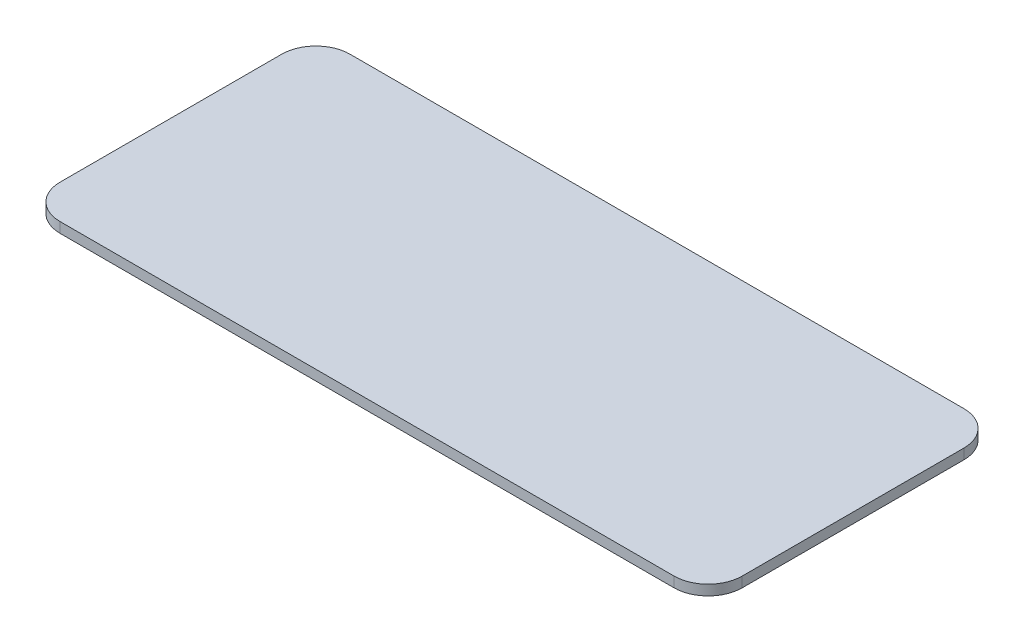
ISO-10303-21;
HEADER;
FILE_DESCRIPTION(('STEP AP214'),'2;1');
FILE_NAME('part.step','',(''),(''),'','','');
FILE_SCHEMA(('AUTOMOTIVE_DESIGN { 1 0 10303 214 1 1 1 1 }'));
ENDSEC;
DATA;
#1=APPLICATION_CONTEXT('core data for automotive mechanical design processes');
#2=APPLICATION_PROTOCOL_DEFINITION('international standard','automotive_design',2000,#1);
#3=PRODUCT_CONTEXT('',#1,'mechanical');
#4=PRODUCT('Part','Part','',(#3));
#5=PRODUCT_RELATED_PRODUCT_CATEGORY('part','',(#4));
#6=PRODUCT_DEFINITION_FORMATION('','',#4);
#7=PRODUCT_DEFINITION_CONTEXT('part definition',#1,'design');
#8=PRODUCT_DEFINITION('design','',#6,#7);
#9=PRODUCT_DEFINITION_SHAPE('','',#8);
#10=(LENGTH_UNIT() NAMED_UNIT(*) SI_UNIT(.MILLI.,.METRE.));
#11=(NAMED_UNIT(*) PLANE_ANGLE_UNIT() SI_UNIT($,.RADIAN.));
#12=(NAMED_UNIT(*) SI_UNIT($,.STERADIAN.) SOLID_ANGLE_UNIT());
#13=UNCERTAINTY_MEASURE_WITH_UNIT(LENGTH_MEASURE(1.E-05),#10,'distance_accuracy_value','');
#14=(GEOMETRIC_REPRESENTATION_CONTEXT(3) GLOBAL_UNCERTAINTY_ASSIGNED_CONTEXT((#13)) GLOBAL_UNIT_ASSIGNED_CONTEXT((#10,
#11,#12)) REPRESENTATION_CONTEXT('',''));
#15=CARTESIAN_POINT('',(0.,0.,0.));
#16=DIRECTION('',(0.,0.,1.));
#17=DIRECTION('',(1.,0.,0.));
#18=AXIS2_PLACEMENT_3D('',#15,#16,#17);
#19=CARTESIAN_POINT('',(-90.,3.,32.5));
#20=DIRECTION('',(0.,-1.,0.));
#21=DIRECTION('',(0.,0.,-1.));
#22=AXIS2_PLACEMENT_3D('',#19,#20,#21);
#23=CYLINDRICAL_SURFACE('',#22,10.);
#24=CARTESIAN_POINT('',(-90.,0.,32.5));
#25=DIRECTION('',(0.,1.,0.));
#26=DIRECTION('',(0.,0.,1.));
#27=AXIS2_PLACEMENT_3D('',#24,#25,#26);
#28=CIRCLE('',#27,10.);
#29=CARTESIAN_POINT('',(-100.,0.,32.4999999999999));
#30=VERTEX_POINT('',#29);
#31=CARTESIAN_POINT('',(-89.9999999999999,0.,42.5));
#32=VERTEX_POINT('',#31);
#33=EDGE_CURVE('E140',#30,#32,#28,.T.);
#34=ORIENTED_EDGE('',*,*,#33,.T.);
#35=DIRECTION('',(0.,-1.,0.));
#36=VECTOR('',#35,1.);
#37=CARTESIAN_POINT('',(-89.9999999999999,3.,42.5));
#38=LINE('',#37,#36);
#39=CARTESIAN_POINT('',(-89.9999999999999,3.,42.5));
#40=VERTEX_POINT('',#39);
#41=EDGE_CURVE('E11',#40,#32,#38,.T.);
#42=ORIENTED_EDGE('',*,*,#41,.F.);
#43=CARTESIAN_POINT('',(-90.,3.,32.5));
#44=DIRECTION('',(0.,1.,0.));
#45=DIRECTION('',(0.,0.,1.));
#46=AXIS2_PLACEMENT_3D('',#43,#44,#45);
#47=CIRCLE('',#46,10.);
#48=CARTESIAN_POINT('',(-100.,3.,32.4999999999999));
#49=VERTEX_POINT('',#48);
#50=EDGE_CURVE('E162',#49,#40,#47,.T.);
#51=ORIENTED_EDGE('',*,*,#50,.F.);
#52=DIRECTION('',(0.,-1.,0.));
#53=VECTOR('',#52,1.);
#54=CARTESIAN_POINT('',(-100.,3.,32.4999999999999));
#55=LINE('',#54,#53);
#56=EDGE_CURVE('E136',#49,#30,#55,.T.);
#57=ORIENTED_EDGE('',*,*,#56,.T.);
#58=EDGE_LOOP('',(#34,#42,#51,#57));
#59=FACE_BOUND('',#58,.T.);
#60=ADVANCED_FACE('F39',(#59),#23,.T.);
#61=CARTESIAN_POINT('',(-89.9999999999999,3.,42.5));
#62=DIRECTION('',(0.,0.,-1.));
#63=DIRECTION('',(-1.,0.,0.));
#64=AXIS2_PLACEMENT_3D('',#61,#62,#63);
#65=PLANE('',#64);
#66=DIRECTION('',(1.,0.,0.));
#67=VECTOR('',#66,1.);
#68=CARTESIAN_POINT('',(-89.9999999999999,0.,42.5));
#69=LINE('',#68,#67);
#70=CARTESIAN_POINT('',(89.9999999999999,0.,42.5));
#71=VERTEX_POINT('',#70);
#72=EDGE_CURVE('E144',#32,#71,#69,.T.);
#73=ORIENTED_EDGE('',*,*,#72,.T.);
#74=DIRECTION('',(0.,-1.,0.));
#75=VECTOR('',#74,1.);
#76=CARTESIAN_POINT('',(89.9999999999999,3.,42.5));
#77=LINE('',#76,#75);
#78=CARTESIAN_POINT('',(89.9999999999999,3.,42.5));
#79=VERTEX_POINT('',#78);
#80=EDGE_CURVE('E48',#79,#71,#77,.T.);
#81=ORIENTED_EDGE('',*,*,#80,.F.);
#82=DIRECTION('',(1.,0.,0.));
#83=VECTOR('',#82,1.);
#84=CARTESIAN_POINT('',(-89.9999999999999,3.,42.5));
#85=LINE('',#84,#83);
#86=EDGE_CURVE('E99',#40,#79,#85,.T.);
#87=ORIENTED_EDGE('',*,*,#86,.F.);
#88=ORIENTED_EDGE('',*,*,#41,.T.);
#89=EDGE_LOOP('',(#73,#81,#87,#88));
#90=FACE_BOUND('',#89,.T.);
#91=ADVANCED_FACE('F208',(#90),#65,.F.);
#92=CARTESIAN_POINT('',(90.,3.,32.5));
#93=DIRECTION('',(0.,-1.,0.));
#94=DIRECTION('',(0.,0.,-1.));
#95=AXIS2_PLACEMENT_3D('',#92,#93,#94);
#96=CYLINDRICAL_SURFACE('',#95,10.);
#97=CARTESIAN_POINT('',(90.,0.,32.5));
#98=DIRECTION('',(0.,1.,0.));
#99=DIRECTION('',(0.,0.,1.));
#100=AXIS2_PLACEMENT_3D('',#97,#98,#99);
#101=CIRCLE('',#100,10.);
#102=CARTESIAN_POINT('',(100.,0.,32.4999999999999));
#103=VERTEX_POINT('',#102);
#104=EDGE_CURVE('E147',#71,#103,#101,.T.);
#105=ORIENTED_EDGE('',*,*,#104,.T.);
#106=DIRECTION('',(0.,-1.,0.));
#107=VECTOR('',#106,1.);
#108=CARTESIAN_POINT('',(100.,3.,32.4999999999999));
#109=LINE('',#108,#107);
#110=CARTESIAN_POINT('',(100.,3.,32.4999999999999));
#111=VERTEX_POINT('',#110);
#112=EDGE_CURVE('E173',#111,#103,#109,.T.);
#113=ORIENTED_EDGE('',*,*,#112,.F.);
#114=CARTESIAN_POINT('',(90.,3.,32.5));
#115=DIRECTION('',(0.,1.,0.));
#116=DIRECTION('',(0.,0.,1.));
#117=AXIS2_PLACEMENT_3D('',#114,#115,#116);
#118=CIRCLE('',#117,10.);
#119=EDGE_CURVE('E183',#79,#111,#118,.T.);
#120=ORIENTED_EDGE('',*,*,#119,.F.);
#121=ORIENTED_EDGE('',*,*,#80,.T.);
#122=EDGE_LOOP('',(#105,#113,#120,#121));
#123=FACE_BOUND('',#122,.T.);
#124=ADVANCED_FACE('F181',(#123),#96,.T.);
#125=CARTESIAN_POINT('',(100.,3.,-32.4999999999999));
#126=DIRECTION('',(-1.,0.,0.));
#127=DIRECTION('',(0.,0.,1.));
#128=AXIS2_PLACEMENT_3D('',#125,#126,#127);
#129=PLANE('',#128);
#130=DIRECTION('',(0.,0.,-1.));
#131=VECTOR('',#130,1.);
#132=CARTESIAN_POINT('',(100.,0.,-32.4999999999999));
#133=LINE('',#132,#131);
#134=CARTESIAN_POINT('',(100.,0.,-32.4999999999999));
#135=VERTEX_POINT('',#134);
#136=EDGE_CURVE('E150',#103,#135,#133,.T.);
#137=ORIENTED_EDGE('',*,*,#136,.T.);
#138=DIRECTION('',(0.,-1.,0.));
#139=VECTOR('',#138,1.);
#140=CARTESIAN_POINT('',(100.,3.,-32.4999999999999));
#141=LINE('',#140,#139);
#142=CARTESIAN_POINT('',(100.,3.,-32.4999999999999));
#143=VERTEX_POINT('',#142);
#144=EDGE_CURVE('E169',#143,#135,#141,.T.);
#145=ORIENTED_EDGE('',*,*,#144,.F.);
#146=DIRECTION('',(0.,0.,-1.));
#147=VECTOR('',#146,1.);
#148=CARTESIAN_POINT('',(100.,3.,-32.4999999999999));
#149=LINE('',#148,#147);
#150=EDGE_CURVE('E196',#111,#143,#149,.T.);
#151=ORIENTED_EDGE('',*,*,#150,.F.);
#152=ORIENTED_EDGE('',*,*,#112,.T.);
#153=EDGE_LOOP('',(#137,#145,#151,#152));
#154=FACE_BOUND('',#153,.T.);
#155=ADVANCED_FACE('F191',(#154),#129,.F.);
#156=CARTESIAN_POINT('',(90.,3.,-32.5));
#157=DIRECTION('',(0.,-1.,0.));
#158=DIRECTION('',(0.,0.,-1.));
#159=AXIS2_PLACEMENT_3D('',#156,#157,#158);
#160=CYLINDRICAL_SURFACE('',#159,10.);
#161=CARTESIAN_POINT('',(90.,0.,-32.5));
#162=DIRECTION('',(0.,1.,0.));
#163=DIRECTION('',(0.,0.,1.));
#164=AXIS2_PLACEMENT_3D('',#161,#162,#163);
#165=CIRCLE('',#164,10.);
#166=CARTESIAN_POINT('',(89.9999999999999,0.,-42.5));
#167=VERTEX_POINT('',#166);
#168=EDGE_CURVE('E153',#135,#167,#165,.T.);
#169=ORIENTED_EDGE('',*,*,#168,.T.);
#170=DIRECTION('',(0.,-1.,0.));
#171=VECTOR('',#170,1.);
#172=CARTESIAN_POINT('',(89.9999999999999,3.,-42.5));
#173=LINE('',#172,#171);
#174=CARTESIAN_POINT('',(89.9999999999999,3.,-42.5));
#175=VERTEX_POINT('',#174);
#176=EDGE_CURVE('E129',#175,#167,#173,.T.);
#177=ORIENTED_EDGE('',*,*,#176,.F.);
#178=CARTESIAN_POINT('',(90.,3.,-32.5));
#179=DIRECTION('',(0.,1.,0.));
#180=DIRECTION('',(0.,0.,1.));
#181=AXIS2_PLACEMENT_3D('',#178,#179,#180);
#182=CIRCLE('',#181,10.);
#183=EDGE_CURVE('E118',#143,#175,#182,.T.);
#184=ORIENTED_EDGE('',*,*,#183,.F.);
#185=ORIENTED_EDGE('',*,*,#144,.T.);
#186=EDGE_LOOP('',(#169,#177,#184,#185));
#187=FACE_BOUND('',#186,.T.);
#188=ADVANCED_FACE('F194',(#187),#160,.T.);
#189=CARTESIAN_POINT('',(-89.9999999999999,3.,-42.5));
#190=DIRECTION('',(0.,0.,1.));
#191=DIRECTION('',(1.,0.,0.));
#192=AXIS2_PLACEMENT_3D('',#189,#190,#191);
#193=PLANE('',#192);
#194=DIRECTION('',(-1.,0.,0.));
#195=VECTOR('',#194,1.);
#196=CARTESIAN_POINT('',(-89.9999999999999,0.,-42.5));
#197=LINE('',#196,#195);
#198=CARTESIAN_POINT('',(-89.9999999999999,0.,-42.5));
#199=VERTEX_POINT('',#198);
#200=EDGE_CURVE('E127',#167,#199,#197,.T.);
#201=ORIENTED_EDGE('',*,*,#200,.T.);
#202=DIRECTION('',(0.,-1.,0.));
#203=VECTOR('',#202,1.);
#204=CARTESIAN_POINT('',(-89.9999999999999,3.,-42.5));
#205=LINE('',#204,#203);
#206=CARTESIAN_POINT('',(-89.9999999999999,3.,-42.5));
#207=VERTEX_POINT('',#206);
#208=EDGE_CURVE('E124',#207,#199,#205,.T.);
#209=ORIENTED_EDGE('',*,*,#208,.F.);
#210=DIRECTION('',(-1.,0.,0.));
#211=VECTOR('',#210,1.);
#212=CARTESIAN_POINT('',(-89.9999999999999,3.,-42.5));
#213=LINE('',#212,#211);
#214=EDGE_CURVE('E112',#175,#207,#213,.T.);
#215=ORIENTED_EDGE('',*,*,#214,.F.);
#216=ORIENTED_EDGE('',*,*,#176,.T.);
#217=EDGE_LOOP('',(#201,#209,#215,#216));
#218=FACE_BOUND('',#217,.T.);
#219=ADVANCED_FACE('F125',(#218),#193,.F.);
#220=CARTESIAN_POINT('',(-90.,3.,-32.5));
#221=DIRECTION('',(0.,-1.,0.));
#222=DIRECTION('',(0.,0.,-1.));
#223=AXIS2_PLACEMENT_3D('',#220,#221,#222);
#224=CYLINDRICAL_SURFACE('',#223,10.);
#225=CARTESIAN_POINT('',(-90.,0.,-32.5));
#226=DIRECTION('',(0.,1.,0.));
#227=DIRECTION('',(0.,0.,1.));
#228=AXIS2_PLACEMENT_3D('',#225,#226,#227);
#229=CIRCLE('',#228,10.);
#230=CARTESIAN_POINT('',(-100.,0.,-32.4999999999999));
#231=VERTEX_POINT('',#230);
#232=EDGE_CURVE('E85',#199,#231,#229,.T.);
#233=ORIENTED_EDGE('',*,*,#232,.T.);
#234=DIRECTION('',(0.,-1.,0.));
#235=VECTOR('',#234,1.);
#236=CARTESIAN_POINT('',(-100.,3.,-32.4999999999999));
#237=LINE('',#236,#235);
#238=CARTESIAN_POINT('',(-100.,3.,-32.4999999999999));
#239=VERTEX_POINT('',#238);
#240=EDGE_CURVE('E130',#239,#231,#237,.T.);
#241=ORIENTED_EDGE('',*,*,#240,.F.);
#242=CARTESIAN_POINT('',(-90.,3.,-32.5));
#243=DIRECTION('',(0.,1.,0.));
#244=DIRECTION('',(0.,0.,1.));
#245=AXIS2_PLACEMENT_3D('',#242,#243,#244);
#246=CIRCLE('',#245,10.);
#247=EDGE_CURVE('E116',#207,#239,#246,.T.);
#248=ORIENTED_EDGE('',*,*,#247,.F.);
#249=ORIENTED_EDGE('',*,*,#208,.T.);
#250=EDGE_LOOP('',(#233,#241,#248,#249));
#251=FACE_BOUND('',#250,.T.);
#252=ADVANCED_FACE('F132',(#251),#224,.T.);
#253=CARTESIAN_POINT('',(-100.,3.,-32.4999999999999));
#254=DIRECTION('',(1.,0.,0.));
#255=DIRECTION('',(0.,0.,-1.));
#256=AXIS2_PLACEMENT_3D('',#253,#254,#255);
#257=PLANE('',#256);
#258=DIRECTION('',(0.,0.,1.));
#259=VECTOR('',#258,1.);
#260=CARTESIAN_POINT('',(-100.,0.,-32.4999999999999));
#261=LINE('',#260,#259);
#262=EDGE_CURVE('E91',#231,#30,#261,.T.);
#263=ORIENTED_EDGE('',*,*,#262,.T.);
#264=ORIENTED_EDGE('',*,*,#56,.F.);
#265=DIRECTION('',(0.,0.,1.));
#266=VECTOR('',#265,1.);
#267=CARTESIAN_POINT('',(-100.,3.,-32.4999999999999));
#268=LINE('',#267,#266);
#269=EDGE_CURVE('E56',#239,#49,#268,.T.);
#270=ORIENTED_EDGE('',*,*,#269,.F.);
#271=ORIENTED_EDGE('',*,*,#240,.T.);
#272=EDGE_LOOP('',(#263,#264,#270,#271));
#273=FACE_BOUND('',#272,.T.);
#274=ADVANCED_FACE('F224',(#273),#257,.F.);
#275=CARTESIAN_POINT('',(-90.,3.,32.5));
#276=DIRECTION('',(0.,1.,0.));
#277=DIRECTION('',(0.,0.,1.));
#278=AXIS2_PLACEMENT_3D('',#275,#276,#277);
#279=PLANE('',#278);
#280=ORIENTED_EDGE('',*,*,#50,.T.);
#281=ORIENTED_EDGE('',*,*,#86,.T.);
#282=ORIENTED_EDGE('',*,*,#119,.T.);
#283=ORIENTED_EDGE('',*,*,#150,.T.);
#284=ORIENTED_EDGE('',*,*,#183,.T.);
#285=ORIENTED_EDGE('',*,*,#214,.T.);
#286=ORIENTED_EDGE('',*,*,#247,.T.);
#287=ORIENTED_EDGE('',*,*,#269,.T.);
#288=EDGE_LOOP('',(#280,#281,#282,#283,#284,#285,#286,#287));
#289=FACE_BOUND('',#288,.T.);
#290=ADVANCED_FACE('F114',(#289),#279,.T.);
#291=CARTESIAN_POINT('',(-90.,0.,32.5));
#292=DIRECTION('',(0.,1.,0.));
#293=DIRECTION('',(0.,0.,1.));
#294=AXIS2_PLACEMENT_3D('',#291,#292,#293);
#295=PLANE('',#294);
#296=ORIENTED_EDGE('',*,*,#33,.F.);
#297=ORIENTED_EDGE('',*,*,#262,.F.);
#298=ORIENTED_EDGE('',*,*,#232,.F.);
#299=ORIENTED_EDGE('',*,*,#200,.F.);
#300=ORIENTED_EDGE('',*,*,#168,.F.);
#301=ORIENTED_EDGE('',*,*,#136,.F.);
#302=ORIENTED_EDGE('',*,*,#104,.F.);
#303=ORIENTED_EDGE('',*,*,#72,.F.);
#304=EDGE_LOOP('',(#296,#297,#298,#299,#300,#301,#302,#303));
#305=FACE_BOUND('',#304,.T.);
#306=ADVANCED_FACE('F187',(#305),#295,.F.);
#307=CLOSED_SHELL('',(#60,#91,#124,#155,#188,#219,#252,#274,#290,#306));
#308=MANIFOLD_SOLID_BREP('B2',#307);
#309=ADVANCED_BREP_SHAPE_REPRESENTATION('',(#18,#308),#14);
#310=SHAPE_DEFINITION_REPRESENTATION(#9,#309);
ENDSEC;
END-ISO-10303-21;
